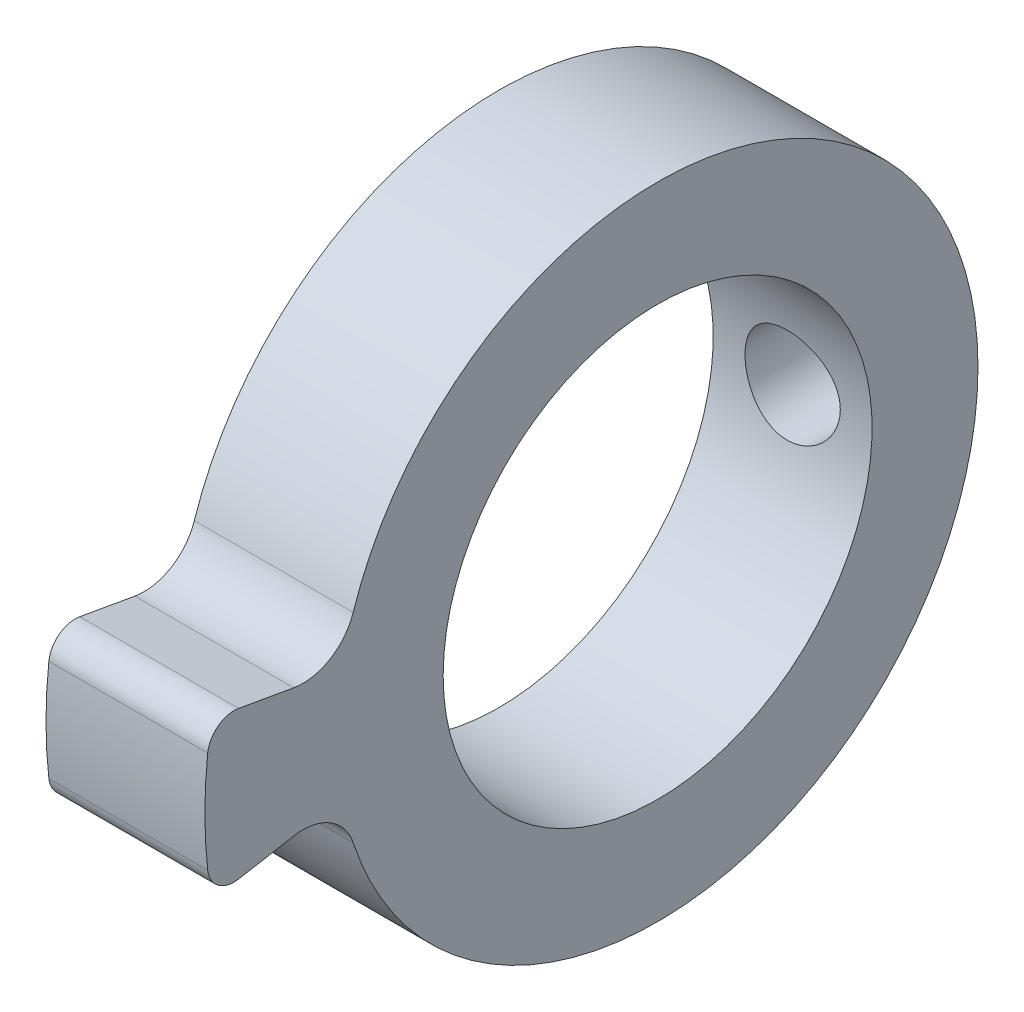
ISO-10303-21;
HEADER;
FILE_DESCRIPTION(('STEP AP214'),'2;1');
FILE_NAME('part.step','',(''),(''),'','','');
FILE_SCHEMA(('AUTOMOTIVE_DESIGN { 1 0 10303 214 1 1 1 1 }'));
ENDSEC;
DATA;
#1=APPLICATION_CONTEXT('core data for automotive mechanical design processes');
#2=APPLICATION_PROTOCOL_DEFINITION('international standard','automotive_design',2000,#1);
#3=PRODUCT_CONTEXT('',#1,'mechanical');
#4=PRODUCT('Part','Part','',(#3));
#5=PRODUCT_RELATED_PRODUCT_CATEGORY('part','',(#4));
#6=PRODUCT_DEFINITION_FORMATION('','',#4);
#7=PRODUCT_DEFINITION_CONTEXT('part definition',#1,'design');
#8=PRODUCT_DEFINITION('design','',#6,#7);
#9=PRODUCT_DEFINITION_SHAPE('','',#8);
#10=(LENGTH_UNIT() NAMED_UNIT(*) SI_UNIT(.MILLI.,.METRE.));
#11=(NAMED_UNIT(*) PLANE_ANGLE_UNIT() SI_UNIT($,.RADIAN.));
#12=(NAMED_UNIT(*) SI_UNIT($,.STERADIAN.) SOLID_ANGLE_UNIT());
#13=UNCERTAINTY_MEASURE_WITH_UNIT(LENGTH_MEASURE(1.E-05),#10,'distance_accuracy_value','');
#14=(GEOMETRIC_REPRESENTATION_CONTEXT(3) GLOBAL_UNCERTAINTY_ASSIGNED_CONTEXT((#13)) GLOBAL_UNIT_ASSIGNED_CONTEXT((#10,
#11,#12)) REPRESENTATION_CONTEXT('',''));
#15=CARTESIAN_POINT('',(0.,0.,0.));
#16=DIRECTION('',(0.,0.,1.));
#17=DIRECTION('',(1.,0.,0.));
#18=AXIS2_PLACEMENT_3D('',#15,#16,#17);
#19=CARTESIAN_POINT('',(-3.99600435518086,0.,0.));
#20=DIRECTION('',(-1.,0.,0.));
#21=DIRECTION('',(0.,0.,1.));
#22=AXIS2_PLACEMENT_3D('',#19,#20,#21);
#23=CYLINDRICAL_SURFACE('',#22,4.05);
#24=CARTESIAN_POINT('',(2.4,0.,-4.05));
#25=CARTESIAN_POINT('',(2.39999832434408,-0.0498962145490416,-4.04999908298213));
#26=CARTESIAN_POINT('',(2.39583660825143,-0.099812504371329,-4.04906856298061));
#27=CARTESIAN_POINT('',(2.37931778744225,-0.19822587484641,-4.04544643990951));
#28=CARTESIAN_POINT('',(2.36695495469582,-0.246721938812544,-4.04275360597807));
#29=CARTESIAN_POINT('',(2.33444131327875,-0.340858474992687,-4.03590650926054));
#30=CARTESIAN_POINT('',(2.31429877035096,-0.386501918445127,-4.03175379797587));
#31=CARTESIAN_POINT('',(2.26682402438742,-0.473760081141192,-4.0224345094862));
#32=CARTESIAN_POINT('',(2.23949196091922,-0.515374878570005,-4.01726795196311));
#33=CARTESIAN_POINT('',(2.17793595070199,-0.594083841306314,-4.00639092378395));
#34=CARTESIAN_POINT('',(2.14361587403918,-0.631101875419589,-4.00067352738642));
#35=CARTESIAN_POINT('',(2.06926437295809,-0.698906209706265,-3.98938770485904));
#36=CARTESIAN_POINT('',(2.02923242668029,-0.729691939848847,-3.98381929239622));
#37=CARTESIAN_POINT('',(1.94402767017376,-0.784495995346575,-3.9733934771777));
#38=CARTESIAN_POINT('',(1.89880126888131,-0.808432839469814,-3.96854494084342));
#39=CARTESIAN_POINT('',(1.80484225723841,-0.848336845295285,-3.96020743358578));
#40=CARTESIAN_POINT('',(1.75611008152309,-0.86430499299043,-3.95671829447147));
#41=CARTESIAN_POINT('',(1.6573499352048,-0.887565861028817,-3.95156524256635));
#42=CARTESIAN_POINT('',(1.60735527820256,-0.894993601671307,-3.94987295613502));
#43=CARTESIAN_POINT('',(1.50680300199621,-0.901382719489527,-3.94842003178801));
#44=CARTESIAN_POINT('',(1.45624545511703,-0.900345172102481,-3.94865914850522));
#45=CARTESIAN_POINT('',(1.35700951776279,-0.889941723827856,-3.95101634466666));
#46=CARTESIAN_POINT('',(1.30831366913729,-0.880733090070975,-3.95309894123178));
#47=CARTESIAN_POINT('',(1.21317578550375,-0.854498208065155,-3.95885229386254));
#48=CARTESIAN_POINT('',(1.16673388076157,-0.83747150856743,-3.96252314159929));
#49=CARTESIAN_POINT('',(1.07698225272815,-0.795940527927934,-3.97107409486633));
#50=CARTESIAN_POINT('',(1.03370130269877,-0.771376137207085,-3.9759638596312));
#51=CARTESIAN_POINT('',(0.951817708267849,-0.715509306629321,-3.98639582059835));
#52=CARTESIAN_POINT('',(0.913215722180935,-0.684205920334232,-3.99193810839269));
#53=CARTESIAN_POINT('',(0.84088081079319,-0.614919076663421,-4.003202585757));
#54=CARTESIAN_POINT('',(0.807275946702726,-0.576801992369803,-4.00892602809542));
#55=CARTESIAN_POINT('',(0.746914321991799,-0.495407978141227,-4.01979527605043));
#56=CARTESIAN_POINT('',(0.720157693298148,-0.452130948826815,-4.02494107053792));
#57=CARTESIAN_POINT('',(0.674218825900438,-0.361486435830629,-4.03409278905123));
#58=CARTESIAN_POINT('',(0.655053790061286,-0.314109955043933,-4.03809611853447));
#59=CARTESIAN_POINT('',(0.62499254412396,-0.216700168941654,-4.04449261364815));
#60=CARTESIAN_POINT('',(0.614095091963645,-0.166667263917013,-4.04688602113553));
#61=CARTESIAN_POINT('',(0.601065594035174,-0.0664629674763795,-4.04975842992753));
#62=CARTESIAN_POINT('',(0.598758674927245,-0.0163153787935067,-4.0502756188003));
#63=CARTESIAN_POINT('',(0.602501146917168,0.0836486657676362,-4.04944451392769));
#64=CARTESIAN_POINT('',(0.608549951993753,0.133465144621791,-4.04809635100707));
#65=CARTESIAN_POINT('',(0.628687236825648,0.230770465798239,-4.04371016441376));
#66=CARTESIAN_POINT('',(0.642683605300554,0.278279321271967,-4.04069151153492));
#67=CARTESIAN_POINT('',(0.678216159350286,0.370274762635124,-4.03330239489058));
#68=CARTESIAN_POINT('',(0.699753001337705,0.414761085004579,-4.02893181344097));
#69=CARTESIAN_POINT('',(0.750116794559545,0.50016889795247,-4.01922968952438));
#70=CARTESIAN_POINT('',(0.779045974352775,0.54102857887451,-4.01388500065611));
#71=CARTESIAN_POINT('',(0.843239062095649,0.617376134244653,-4.00285364557086));
#72=CARTESIAN_POINT('',(0.878503821149446,0.652863285780356,-3.99716693347579));
#73=CARTESIAN_POINT('',(0.955170615111316,0.718152966859433,-3.98595995525615));
#74=CARTESIAN_POINT('',(0.996676840502971,0.747834218730328,-3.98044492948928));
#75=CARTESIAN_POINT('',(1.08418741548487,0.799805753652383,-3.97032927920239));
#76=CARTESIAN_POINT('',(1.13019156840394,0.82209635967138,-3.96572861472872));
#77=CARTESIAN_POINT('',(1.22514373009731,0.858501008533164,-3.95800740247017));
#78=CARTESIAN_POINT('',(1.27407319902098,0.872661538596414,-3.95487845846904));
#79=CARTESIAN_POINT('',(1.37369588318811,0.892539124462824,-3.95044042363826));
#80=CARTESIAN_POINT('',(1.42438880446168,0.898257580732601,-3.94913103096299));
#81=CARTESIAN_POINT('',(1.52487549522525,0.901027604884696,-3.9484998065204));
#82=CARTESIAN_POINT('',(1.57466377862703,0.898271609147698,-3.94913384266556));
#83=CARTESIAN_POINT('',(1.67304736948507,0.884602247047593,-3.95221799230896));
#84=CARTESIAN_POINT('',(1.72164269194057,0.873688983301075,-3.95466808296165));
#85=CARTESIAN_POINT('',(1.81610210410232,0.844109189913348,-3.96108642659186));
#86=CARTESIAN_POINT('',(1.86197564259672,0.825471524828039,-3.96504902332246));
#87=CARTESIAN_POINT('',(1.94997299664603,0.780996466567537,-3.97404794011076));
#88=CARTESIAN_POINT('',(1.9920964064838,0.755158295633369,-3.97908437614485));
#89=CARTESIAN_POINT('',(2.07234447402659,0.696381115457509,-3.98979469275898));
#90=CARTESIAN_POINT('',(2.11036749221519,0.66330533479967,-3.99547967115483));
#91=CARTESIAN_POINT('',(2.1803865332691,0.591267917675266,-4.00677288378024));
#92=CARTESIAN_POINT('',(2.21238115822878,0.552304919805044,-4.01238109993074));
#93=CARTESIAN_POINT('',(2.26984919231396,0.468965686790503,-4.02297866876961));
#94=CARTESIAN_POINT('',(2.29522883988072,0.424523536485726,-4.02795865574653));
#95=CARTESIAN_POINT('',(2.33811748688154,0.331902125900467,-4.03664426266162));
#96=CARTESIAN_POINT('',(2.35563298802077,0.283725991490847,-4.04035093471867));
#97=CARTESIAN_POINT('',(2.37922860762455,0.196262211478233,-4.04542265809299));
#98=CARTESIAN_POINT('',(2.38700281814983,0.157442396355756,-4.04712841060445));
#99=CARTESIAN_POINT('',(2.39738905693777,0.0790859024525372,-4.04941741856905));
#100=CARTESIAN_POINT('',(2.40000132817585,0.039549257501795,-4.05000072685626));
#101=CARTESIAN_POINT('',(2.4,0.,-4.05));
#102=B_SPLINE_CURVE_WITH_KNOTS('',3,(#24,#25,#26,#27,#28,#29,#30,#31,#32,#33,#34,#35,#36,#37,
#38,#39,#40,#41,#42,#43,#44,#45,#46,#47,#48,#49,#50,#51,#52,#53,#54,#55,#56,#57,#58,#59,#60,#61,
#62,#63,#64,#65,#66,#67,#68,#69,#70,#71,#72,#73,#74,#75,#76,#77,#78,#79,#80,#81,#82,#83,#84,#85,
#86,#87,#88,#89,#90,#91,#92,#93,#94,#95,#96,#97,#98,#99,#100,#101),.UNSPECIFIED.,.T.,.F.,(4,2,2,
2,2,2,2,2,2,2,2,2,2,2,2,2,2,2,2,2,2,2,2,2,2,2,2,2,2,2,2,2,2,2,2,2,2,2,4),(0.,0.149543860378408,
0.299192279062177,0.448682135583355,0.59816909032645,0.749871324009353,0.901587426707311,
1.05503983334089,1.20847324809483,1.35944606537148,1.51039970323465,1.65850950665602,
1.80662785986122,1.95595951369311,2.10531215366235,2.25800180914039,2.41069440586422,
2.56373105765056,2.71674471375894,2.8666259645592,3.0164967041052,3.16466491241324,
3.31284602225456,3.46319911467918,3.6135724202449,3.76681262897577,3.92004614029684,
4.07239451574859,4.22471761508884,4.37360753314086,4.52249557822286,4.670832204071,
4.81918485863873,4.9706294684077,5.12210915309884,5.27563164172304,5.4290269704192,
5.54756556311349,5.66609857599577),.UNSPECIFIED.);
#103=CARTESIAN_POINT('',(2.4,0.,-4.05));
#104=VERTEX_POINT('',#103);
#105=EDGE_CURVE('E169',#104,#104,#102,.T.);
#106=ORIENTED_EDGE('',*,*,#105,.T.);
#107=EDGE_LOOP('',(#106));
#108=FACE_BOUND('',#107,.T.);
#109=CARTESIAN_POINT('',(3.,0.,0.));
#110=DIRECTION('',(-1.,0.,0.));
#111=DIRECTION('',(0.,0.,1.));
#112=AXIS2_PLACEMENT_3D('',#109,#110,#111);
#113=CIRCLE('',#112,4.05);
#114=CARTESIAN_POINT('',(3.,0.,4.05));
#115=VERTEX_POINT('',#114);
#116=EDGE_CURVE('E181',#115,#115,#113,.T.);
#117=ORIENTED_EDGE('',*,*,#116,.F.);
#118=EDGE_LOOP('',(#117));
#119=FACE_BOUND('',#118,.T.);
#120=CARTESIAN_POINT('',(0.,0.,0.));
#121=DIRECTION('',(-1.,0.,0.));
#122=DIRECTION('',(0.,0.,1.));
#123=AXIS2_PLACEMENT_3D('',#120,#121,#122);
#124=CIRCLE('',#123,4.05);
#125=CARTESIAN_POINT('',(0.,0.,4.05));
#126=VERTEX_POINT('',#125);
#127=EDGE_CURVE('E126',#126,#126,#124,.T.);
#128=ORIENTED_EDGE('',*,*,#127,.T.);
#129=EDGE_LOOP('',(#128));
#130=FACE_BOUND('',#129,.T.);
#131=ADVANCED_FACE('F32',(#108,#119,#130),#23,.F.);
#132=CARTESIAN_POINT('',(0.,4.05,0.));
#133=DIRECTION('',(1.,0.,0.));
#134=DIRECTION('',(0.,0.,-1.));
#135=AXIS2_PLACEMENT_3D('',#132,#133,#134);
#136=PLANE('',#135);
#137=ORIENTED_EDGE('',*,*,#127,.F.);
#138=EDGE_LOOP('',(#137));
#139=FACE_BOUND('',#138,.T.);
#140=CARTESIAN_POINT('',(0.,0.,0.));
#141=DIRECTION('',(-1.,0.,0.));
#142=DIRECTION('',(0.,0.,1.));
#143=AXIS2_PLACEMENT_3D('',#140,#141,#142);
#144=CIRCLE('',#143,8.55);
#145=CARTESIAN_POINT('',(0.,-0.958837304822639,8.49606562020801));
#146=VERTEX_POINT('',#145);
#147=CARTESIAN_POINT('',(0.,0.958837304822639,8.49606562020801));
#148=VERTEX_POINT('',#147);
#149=EDGE_CURVE('E168',#146,#148,#144,.T.);
#150=ORIENTED_EDGE('',*,*,#149,.T.);
#151=CARTESIAN_POINT('',(0.,0.902764947815467,7.99921967750578));
#152=DIRECTION('',(1.,0.,0.));
#153=DIRECTION('',(0.,0.,-1.));
#154=AXIS2_PLACEMENT_3D('',#151,#152,#153);
#155=CIRCLE('',#154,0.5);
#156=CARTESIAN_POINT('',(0.,1.39516882432157,7.91239558867232));
#157=VERTEX_POINT('',#156);
#158=EDGE_CURVE('E152',#148,#157,#155,.F.);
#159=ORIENTED_EDGE('',*,*,#158,.T.);
#160=DIRECTION('',(0.,-0.173648177666931,-0.984807753012208));
#161=VECTOR('',#160,1.);
#162=CARTESIAN_POINT('',(0.,1.05057147488493,5.95808690572386));
#163=LINE('',#162,#161);
#164=CARTESIAN_POINT('',(0.,1.21184160189653,6.87269524509219));
#165=VERTEX_POINT('',#164);
#166=EDGE_CURVE('E110',#157,#165,#163,.T.);
#167=ORIENTED_EDGE('',*,*,#166,.T.);
#168=CARTESIAN_POINT('',(0.,2.19664935490874,6.69904706742526));
#169=DIRECTION('',(1.,0.,0.));
#170=DIRECTION('',(0.,0.,-1.));
#171=AXIS2_PLACEMENT_3D('',#168,#169,#170);
#172=CIRCLE('',#171,1.);
#173=CARTESIAN_POINT('',(0.,1.88506788612736,5.74882762523728));
#174=VERTEX_POINT('',#173);
#175=EDGE_CURVE('E105',#165,#174,#172,.T.);
#176=ORIENTED_EDGE('',*,*,#175,.T.);
#177=CARTESIAN_POINT('',(0.,0.,0.));
#178=DIRECTION('',(-1.,0.,0.));
#179=DIRECTION('',(0.,0.,1.));
#180=AXIS2_PLACEMENT_3D('',#177,#178,#179);
#181=CIRCLE('',#180,6.05);
#182=CARTESIAN_POINT('',(0.,-1.88506788612736,5.74882762523728));
#183=VERTEX_POINT('',#182);
#184=EDGE_CURVE('E109',#174,#183,#181,.T.);
#185=ORIENTED_EDGE('',*,*,#184,.T.);
#186=CARTESIAN_POINT('',(0.,-2.19664935490874,6.69904706742526));
#187=DIRECTION('',(1.,0.,0.));
#188=DIRECTION('',(0.,0.,-1.));
#189=AXIS2_PLACEMENT_3D('',#186,#187,#188);
#190=CIRCLE('',#189,1.);
#191=CARTESIAN_POINT('',(0.,-1.21184160189653,6.87269524509219));
#192=VERTEX_POINT('',#191);
#193=EDGE_CURVE('E141',#183,#192,#190,.T.);
#194=ORIENTED_EDGE('',*,*,#193,.T.);
#195=DIRECTION('',(0.,-0.173648177666931,0.984807753012208));
#196=VECTOR('',#195,1.);
#197=CARTESIAN_POINT('',(0.,-1.05057147488493,5.95808690572386));
#198=LINE('',#197,#196);
#199=CARTESIAN_POINT('',(0.,-1.39516882432157,7.91239558867232));
#200=VERTEX_POINT('',#199);
#201=EDGE_CURVE('E163',#192,#200,#198,.T.);
#202=ORIENTED_EDGE('',*,*,#201,.T.);
#203=CARTESIAN_POINT('',(0.,-0.902764947815467,7.99921967750578));
#204=DIRECTION('',(1.,0.,0.));
#205=DIRECTION('',(0.,0.,-1.));
#206=AXIS2_PLACEMENT_3D('',#203,#204,#205);
#207=CIRCLE('',#206,0.5);
#208=EDGE_CURVE('E150',#200,#146,#207,.F.);
#209=ORIENTED_EDGE('',*,*,#208,.T.);
#210=EDGE_LOOP('',(#150,#159,#167,#176,#185,#194,#202,#209));
#211=FACE_BOUND('',#210,.T.);
#212=ADVANCED_FACE('F108',(#139,#211),#136,.F.);
#213=CARTESIAN_POINT('',(-3.99600435518086,0.,0.));
#214=DIRECTION('',(-1.,0.,0.));
#215=DIRECTION('',(0.,0.,1.));
#216=AXIS2_PLACEMENT_3D('',#213,#214,#215);
#217=CYLINDRICAL_SURFACE('',#216,6.05);
#218=CARTESIAN_POINT('',(2.4,0.,-6.05));
#219=CARTESIAN_POINT('',(2.39999792378745,0.0502558634951687,-6.04999919917789));
#220=CARTESIAN_POINT('',(2.39577637052018,0.100541008798927,-6.04936724008117));
#221=CARTESIAN_POINT('',(2.37900578102299,0.199706092458043,-6.0469070495936));
#222=CARTESIAN_POINT('',(2.36644860488621,0.248584608484365,-6.04507764890083));
#223=CARTESIAN_POINT('',(2.33339000075672,0.343486938998112,-6.04042818589971));
#224=CARTESIAN_POINT('',(2.31289454210534,0.389512868445747,-6.03760886812672));
#225=CARTESIAN_POINT('',(2.2645556718985,0.477465114100465,-6.03129121336626));
#226=CARTESIAN_POINT('',(2.2367132936443,0.51939200567767,-6.02779297188373));
#227=CARTESIAN_POINT('',(2.17424279954044,0.59828550582681,-6.02047649259506));
#228=CARTESIAN_POINT('',(2.13956935124769,0.635216033792256,-6.01665622031005));
#229=CARTESIAN_POINT('',(2.06451851111655,0.702757216959348,-6.00914219737157));
#230=CARTESIAN_POINT('',(2.02414079354164,0.733367511004559,-6.00544845395837));
#231=CARTESIAN_POINT('',(1.93858557311659,0.787539455289645,-5.99858595303456));
#232=CARTESIAN_POINT('',(1.89338577334668,0.811066253318218,-5.99541982448867));
#233=CARTESIAN_POINT('',(1.79962124823457,0.850180648282277,-5.98999876374504));
#234=CARTESIAN_POINT('',(1.75105670340181,0.865768670737423,-5.98774378271098));
#235=CARTESIAN_POINT('',(1.65232047067389,0.888451097702981,-5.98442030700855));
#236=CARTESIAN_POINT('',(1.60216325894411,0.895607230877466,-5.98334319357415));
#237=CARTESIAN_POINT('',(1.50134923640799,0.901413960799804,-5.98247123098475));
#238=CARTESIAN_POINT('',(1.45069245398288,0.900065037982499,-5.98267630940111));
#239=CARTESIAN_POINT('',(1.35075299342789,0.888950404759469,-5.98433767759988));
#240=CARTESIAN_POINT('',(1.30146247957095,0.87925340427783,-5.98578375289325));
#241=CARTESIAN_POINT('',(1.20521600960918,0.851825417432666,-5.98974822347629));
#242=CARTESIAN_POINT('',(1.1582601185914,0.834094207222297,-5.99226664864335));
#243=CARTESIAN_POINT('',(1.06780650989359,0.791029534188185,-5.99810335455463));
#244=CARTESIAN_POINT('',(1.02432287292084,0.765666927295336,-6.00142469186245));
#245=CARTESIAN_POINT('',(0.942202654784249,0.70808017284055,-6.00849077354763));
#246=CARTESIAN_POINT('',(0.903566386839398,0.675855582245202,-6.01223554525606));
#247=CARTESIAN_POINT('',(0.831839399777447,0.605082243999626,-6.01977169992947));
#248=CARTESIAN_POINT('',(0.79880696001187,0.566474413726025,-6.02356317908749));
#249=CARTESIAN_POINT('',(0.739681489989974,0.484232010172869,-6.0307313258485));
#250=CARTESIAN_POINT('',(0.713588489223701,0.440597415532558,-6.03410799168866));
#251=CARTESIAN_POINT('',(0.669079743077999,0.349489892166042,-6.04006949764793));
#252=CARTESIAN_POINT('',(0.65066844878884,0.302014757042686,-6.04265387845581));
#253=CARTESIAN_POINT('',(0.622096174679114,0.204599449340241,-6.04673576893956));
#254=CARTESIAN_POINT('',(0.611934646366473,0.154659440874391,-6.0482333508714));
#255=CARTESIAN_POINT('',(0.600227743262345,0.0542350418340052,-6.04996334640894));
#256=CARTESIAN_POINT('',(0.598602237568765,0.0037601876533022,-6.05020752569304));
#257=CARTESIAN_POINT('',(0.603800895151379,-0.0967413833519919,-6.04943521685332));
#258=CARTESIAN_POINT('',(0.610624801277762,-0.146768113768133,-6.04841876709555));
#259=CARTESIAN_POINT('',(0.632461947416179,-0.244710981036564,-6.04524668869712));
#260=CARTESIAN_POINT('',(0.647436192802801,-0.292636002852724,-6.04309648592326));
#261=CARTESIAN_POINT('',(0.685107863081553,-0.385295169510446,-6.03789723670636));
#262=CARTESIAN_POINT('',(0.707805645490186,-0.430029166525987,-6.03484814865548));
#263=CARTESIAN_POINT('',(0.760468390241755,-0.515389100083239,-6.02816078069074));
#264=CARTESIAN_POINT('',(0.790484236610629,-0.555983319587023,-6.02451843732657));
#265=CARTESIAN_POINT('',(0.856860164719232,-0.6315868178859,-6.0170627366718));
#266=CARTESIAN_POINT('',(0.893220608781471,-0.666595777503481,-6.01324936962375));
#267=CARTESIAN_POINT('',(0.971610123866081,-0.730326159878557,-6.00584415756205));
#268=CARTESIAN_POINT('',(1.01368306407458,-0.758993898921996,-6.00225437599996));
#269=CARTESIAN_POINT('',(1.1020942822889,-0.808855041125473,-5.99573919391685));
#270=CARTESIAN_POINT('',(1.1484324465081,-0.830048643605891,-5.99281377567933));
#271=CARTESIAN_POINT('',(1.2438979595954,-0.864276501533626,-5.9879734393391));
#272=CARTESIAN_POINT('',(1.29301495521933,-0.87733911541536,-5.98605501286513));
#273=CARTESIAN_POINT('',(1.39277624993902,-0.895024513554679,-5.98343650400927));
#274=CARTESIAN_POINT('',(1.44342044521195,-0.899647870224964,-5.98273633899605));
#275=CARTESIAN_POINT('',(1.5442635120879,-0.900310063053321,-5.9826366783385));
#276=CARTESIAN_POINT('',(1.5944618372099,-0.896433303872868,-5.98322439422932));
#277=CARTESIAN_POINT('',(1.69348417431212,-0.880386071992143,-5.98560649731138));
#278=CARTESIAN_POINT('',(1.74230818835128,-0.868215611717846,-5.98740088269475));
#279=CARTESIAN_POINT('',(1.83717323109969,-0.835956118331376,-5.99198969936934));
#280=CARTESIAN_POINT('',(1.88321627058722,-0.815872887533092,-5.99478339774161));
#281=CARTESIAN_POINT('',(1.9712930020803,-0.768366331443815,-6.00105696883444));
#282=CARTESIAN_POINT('',(2.01332656277835,-0.74094276587411,-6.004536864016));
#283=CARTESIAN_POINT('',(2.09262014070007,-0.679226982188195,-6.01183188537711));
#284=CARTESIAN_POINT('',(2.12983122606342,-0.644872226558203,-6.01564987202461));
#285=CARTESIAN_POINT('',(2.19799030152955,-0.570401401426823,-6.02316693062578));
#286=CARTESIAN_POINT('',(2.22893683290985,-0.530283993781821,-6.02686597471499));
#287=CARTESIAN_POINT('',(2.28383756780188,-0.445171640735323,-6.03375118783376));
#288=CARTESIAN_POINT('',(2.3077530467237,-0.400151487867109,-6.03693447467343));
#289=CARTESIAN_POINT('',(2.34764734301484,-0.306707449991162,-6.04240120495461));
#290=CARTESIAN_POINT('',(2.36363440217537,-0.258287159558637,-6.04468558232256));
#291=CARTESIAN_POINT('',(2.38358041280467,-0.17470653937362,-6.04757408670751));
#292=CARTESIAN_POINT('',(2.38972837826445,-0.140062760464099,-6.0484791450006));
#293=CARTESIAN_POINT('',(2.39793887315939,-0.0702840916342137,-6.049692378079));
#294=CARTESIAN_POINT('',(2.40000145211366,-0.0351492076717479,-6.05000056009908));
#295=CARTESIAN_POINT('',(2.4,0.,-6.05));
#296=B_SPLINE_CURVE_WITH_KNOTS('',3,(#218,#219,#220,#221,#222,#223,#224,#225,#226,#227,#228,
#229,#230,#231,#232,#233,#234,#235,#236,#237,#238,#239,#240,#241,#242,#243,#244,#245,#246,#247,
#248,#249,#250,#251,#252,#253,#254,#255,#256,#257,#258,#259,#260,#261,#262,#263,#264,#265,#266,
#267,#268,#269,#270,#271,#272,#273,#274,#275,#276,#277,#278,#279,#280,#281,#282,#283,#284,#285,
#286,#287,#288,#289,#290,#291,#292,#293,#294,#295),.UNSPECIFIED.,.T.,.F.,(4,2,2,2,2,2,2,2,2,2,2,
2,2,2,2,2,2,2,2,2,2,2,2,2,2,2,2,2,2,2,2,2,2,2,2,2,2,2,4),(0.,0.150639154189215,
0.301425627430261,0.452098933387972,0.602751059311278,0.754438835886088,0.906135277941512,
1.05856633786179,1.21098922659237,1.36228917560877,1.51358057804819,1.66363853413199,
1.81370067134456,1.96434332609819,2.11499570981333,2.26712980033454,2.41926453735896,
2.57148730536399,2.72369995189153,2.87448113231156,3.02525772396257,3.17531919860902,
3.32538762042919,3.47653084847425,3.62768271071961,3.7800689929128,3.93245121095909,
4.08429894342621,4.23613637607681,4.38647292360735,4.53680924589779,4.68703553341616,
4.83726673904731,4.98891946878116,5.14060747084663,5.29311590522576,5.44546546920024,
5.55082454028237,5.65618233429584),.UNSPECIFIED.);
#297=CARTESIAN_POINT('',(2.4,0.,-6.05));
#298=VERTEX_POINT('',#297);
#299=EDGE_CURVE('E11',#298,#298,#296,.T.);
#300=ORIENTED_EDGE('',*,*,#299,.T.);
#301=EDGE_LOOP('',(#300));
#302=FACE_BOUND('',#301,.T.);
#303=CARTESIAN_POINT('',(3.,0.,0.));
#304=DIRECTION('',(-1.,0.,0.));
#305=DIRECTION('',(0.,0.,1.));
#306=AXIS2_PLACEMENT_3D('',#303,#304,#305);
#307=CIRCLE('',#306,6.05);
#308=CARTESIAN_POINT('',(3.,1.88506788612736,5.74882762523728));
#309=VERTEX_POINT('',#308);
#310=CARTESIAN_POINT('',(3.,-1.88506788612736,5.74882762523728));
#311=VERTEX_POINT('',#310);
#312=EDGE_CURVE('E127',#309,#311,#307,.T.);
#313=ORIENTED_EDGE('',*,*,#312,.T.);
#314=DIRECTION('',(-1.,0.,0.));
#315=VECTOR('',#314,1.);
#316=CARTESIAN_POINT('',(-3.99600435518086,-1.88506788612736,5.74882762523728));
#317=LINE('',#316,#315);
#318=EDGE_CURVE('E125',#311,#183,#317,.T.);
#319=ORIENTED_EDGE('',*,*,#318,.T.);
#320=ORIENTED_EDGE('',*,*,#184,.F.);
#321=DIRECTION('',(-1.,0.,0.));
#322=VECTOR('',#321,1.);
#323=CARTESIAN_POINT('',(-3.99600435518086,1.88506788612736,5.74882762523728));
#324=LINE('',#323,#322);
#325=EDGE_CURVE('E122',#174,#309,#324,.F.);
#326=ORIENTED_EDGE('',*,*,#325,.T.);
#327=EDGE_LOOP('',(#313,#319,#320,#326));
#328=FACE_BOUND('',#327,.T.);
#329=ADVANCED_FACE('F121',(#302,#328),#217,.T.);
#330=CARTESIAN_POINT('',(3.,6.05,0.));
#331=DIRECTION('',(-1.,0.,0.));
#332=DIRECTION('',(0.,0.,1.));
#333=AXIS2_PLACEMENT_3D('',#330,#331,#332);
#334=PLANE('',#333);
#335=DIRECTION('',(0.,0.173648177666931,0.984807753012208));
#336=VECTOR('',#335,1.);
#337=CARTESIAN_POINT('',(3.,1.05057147488493,5.95808690572386));
#338=LINE('',#337,#336);
#339=CARTESIAN_POINT('',(3.,1.21184160189653,6.87269524509219));
#340=VERTEX_POINT('',#339);
#341=CARTESIAN_POINT('',(3.,1.39516882432157,7.91239558867232));
#342=VERTEX_POINT('',#341);
#343=EDGE_CURVE('E175',#340,#342,#338,.T.);
#344=ORIENTED_EDGE('',*,*,#343,.T.);
#345=CARTESIAN_POINT('',(3.,0.902764947815467,7.99921967750578));
#346=DIRECTION('',(-1.,0.,0.));
#347=DIRECTION('',(0.,0.,1.));
#348=AXIS2_PLACEMENT_3D('',#345,#346,#347);
#349=CIRCLE('',#348,0.5);
#350=CARTESIAN_POINT('',(3.,0.958837304822639,8.49606562020801));
#351=VERTEX_POINT('',#350);
#352=EDGE_CURVE('E156',#342,#351,#349,.F.);
#353=ORIENTED_EDGE('',*,*,#352,.T.);
#354=CARTESIAN_POINT('',(3.,0.,0.));
#355=DIRECTION('',(-1.,0.,0.));
#356=DIRECTION('',(0.,0.,1.));
#357=AXIS2_PLACEMENT_3D('',#354,#355,#356);
#358=CIRCLE('',#357,8.55);
#359=CARTESIAN_POINT('',(3.,-0.958837304822639,8.49606562020801));
#360=VERTEX_POINT('',#359);
#361=EDGE_CURVE('E179',#351,#360,#358,.F.);
#362=ORIENTED_EDGE('',*,*,#361,.T.);
#363=CARTESIAN_POINT('',(3.,-0.902764947815467,7.99921967750578));
#364=DIRECTION('',(-1.,0.,0.));
#365=DIRECTION('',(0.,0.,1.));
#366=AXIS2_PLACEMENT_3D('',#363,#364,#365);
#367=CIRCLE('',#366,0.5);
#368=CARTESIAN_POINT('',(3.,-1.39516882432157,7.91239558867232));
#369=VERTEX_POINT('',#368);
#370=EDGE_CURVE('E52',#360,#369,#367,.F.);
#371=ORIENTED_EDGE('',*,*,#370,.T.);
#372=DIRECTION('',(0.,0.173648177666931,-0.984807753012208));
#373=VECTOR('',#372,1.);
#374=CARTESIAN_POINT('',(3.,-1.05057147488493,5.95808690572386));
#375=LINE('',#374,#373);
#376=CARTESIAN_POINT('',(3.,-1.21184160189653,6.87269524509219));
#377=VERTEX_POINT('',#376);
#378=EDGE_CURVE('E165',#369,#377,#375,.T.);
#379=ORIENTED_EDGE('',*,*,#378,.T.);
#380=CARTESIAN_POINT('',(3.,-2.19664935490874,6.69904706742526));
#381=DIRECTION('',(-1.,0.,0.));
#382=DIRECTION('',(0.,0.,1.));
#383=AXIS2_PLACEMENT_3D('',#380,#381,#382);
#384=CIRCLE('',#383,1.);
#385=EDGE_CURVE('E116',#377,#311,#384,.T.);
#386=ORIENTED_EDGE('',*,*,#385,.T.);
#387=ORIENTED_EDGE('',*,*,#312,.F.);
#388=CARTESIAN_POINT('',(3.,2.19664935490874,6.69904706742526));
#389=DIRECTION('',(-1.,0.,0.));
#390=DIRECTION('',(0.,0.,1.));
#391=AXIS2_PLACEMENT_3D('',#388,#389,#390);
#392=CIRCLE('',#391,1.);
#393=EDGE_CURVE('E115',#309,#340,#392,.T.);
#394=ORIENTED_EDGE('',*,*,#393,.T.);
#395=EDGE_LOOP('',(#344,#353,#362,#371,#379,#386,#387,#394));
#396=FACE_BOUND('',#395,.T.);
#397=ORIENTED_EDGE('',*,*,#116,.T.);
#398=EDGE_LOOP('',(#397));
#399=FACE_BOUND('',#398,.T.);
#400=ADVANCED_FACE('F187',(#396,#399),#334,.F.);
#401=CARTESIAN_POINT('',(6.9414786395814,1.05057147488493,5.95808690572386));
#402=DIRECTION('',(0.,0.984807753012208,-0.173648177666931));
#403=DIRECTION('',(0.,0.173648177666931,0.984807753012208));
#404=AXIS2_PLACEMENT_3D('',#401,#402,#403);
#405=PLANE('',#404);
#406=ORIENTED_EDGE('',*,*,#166,.F.);
#407=DIRECTION('',(-1.,0.,0.));
#408=VECTOR('',#407,1.);
#409=CARTESIAN_POINT('',(6.9414786395814,1.39516882432157,7.91239558867232));
#410=LINE('',#409,#408);
#411=EDGE_CURVE('E60',#157,#342,#410,.F.);
#412=ORIENTED_EDGE('',*,*,#411,.T.);
#413=ORIENTED_EDGE('',*,*,#343,.F.);
#414=DIRECTION('',(-1.,0.,0.));
#415=VECTOR('',#414,1.);
#416=CARTESIAN_POINT('',(6.9414786395814,1.21184160189653,6.87269524509219));
#417=LINE('',#416,#415);
#418=EDGE_CURVE('E139',#340,#165,#417,.T.);
#419=ORIENTED_EDGE('',*,*,#418,.T.);
#420=EDGE_LOOP('',(#406,#412,#413,#419));
#421=FACE_BOUND('',#420,.T.);
#422=ADVANCED_FACE('F191',(#421),#405,.T.);
#423=CARTESIAN_POINT('',(6.9414786395814,0.,0.));
#424=DIRECTION('',(-1.,0.,0.));
#425=DIRECTION('',(0.,0.,1.));
#426=AXIS2_PLACEMENT_3D('',#423,#424,#425);
#427=CYLINDRICAL_SURFACE('',#426,8.55);
#428=ORIENTED_EDGE('',*,*,#361,.F.);
#429=DIRECTION('',(-1.,0.,0.));
#430=VECTOR('',#429,1.);
#431=CARTESIAN_POINT('',(6.9414786395814,0.958837304822639,8.49606562020801));
#432=LINE('',#431,#430);
#433=EDGE_CURVE('E147',#351,#148,#432,.T.);
#434=ORIENTED_EDGE('',*,*,#433,.T.);
#435=ORIENTED_EDGE('',*,*,#149,.F.);
#436=DIRECTION('',(-1.,0.,0.));
#437=VECTOR('',#436,1.);
#438=CARTESIAN_POINT('',(6.9414786395814,-0.958837304822639,8.49606562020801));
#439=LINE('',#438,#437);
#440=EDGE_CURVE('E145',#146,#360,#439,.F.);
#441=ORIENTED_EDGE('',*,*,#440,.T.);
#442=EDGE_LOOP('',(#428,#434,#435,#441));
#443=FACE_BOUND('',#442,.T.);
#444=ADVANCED_FACE('F222',(#443),#427,.T.);
#445=CARTESIAN_POINT('',(6.9414786395814,-1.05057147488493,5.95808690572386));
#446=DIRECTION('',(0.,-0.984807753012208,-0.173648177666931));
#447=DIRECTION('',(0.,0.173648177666931,-0.984807753012208));
#448=AXIS2_PLACEMENT_3D('',#445,#446,#447);
#449=PLANE('',#448);
#450=ORIENTED_EDGE('',*,*,#378,.F.);
#451=DIRECTION('',(-1.,0.,0.));
#452=VECTOR('',#451,1.);
#453=CARTESIAN_POINT('',(6.9414786395814,-1.39516882432157,7.91239558867232));
#454=LINE('',#453,#452);
#455=EDGE_CURVE('E45',#369,#200,#454,.T.);
#456=ORIENTED_EDGE('',*,*,#455,.T.);
#457=ORIENTED_EDGE('',*,*,#201,.F.);
#458=DIRECTION('',(-1.,0.,0.));
#459=VECTOR('',#458,1.);
#460=CARTESIAN_POINT('',(6.9414786395814,-1.21184160189653,6.87269524509219));
#461=LINE('',#460,#459);
#462=EDGE_CURVE('E132',#192,#377,#461,.F.);
#463=ORIENTED_EDGE('',*,*,#462,.T.);
#464=EDGE_LOOP('',(#450,#456,#457,#463));
#465=FACE_BOUND('',#464,.T.);
#466=ADVANCED_FACE('F162',(#465),#449,.T.);
#467=CARTESIAN_POINT('',(-3.99600435518086,-2.19664935490874,6.69904706742526));
#468=DIRECTION('',(-1.,0.,0.));
#469=DIRECTION('',(0.,0.,1.));
#470=AXIS2_PLACEMENT_3D('',#467,#468,#469);
#471=CYLINDRICAL_SURFACE('',#470,1.);
#472=ORIENTED_EDGE('',*,*,#385,.F.);
#473=ORIENTED_EDGE('',*,*,#462,.F.);
#474=ORIENTED_EDGE('',*,*,#193,.F.);
#475=ORIENTED_EDGE('',*,*,#318,.F.);
#476=EDGE_LOOP('',(#472,#473,#474,#475));
#477=FACE_BOUND('',#476,.T.);
#478=ADVANCED_FACE('F186',(#477),#471,.F.);
#479=CARTESIAN_POINT('',(-3.99600435518086,2.19664935490874,6.69904706742526));
#480=DIRECTION('',(-1.,0.,0.));
#481=DIRECTION('',(0.,0.,1.));
#482=AXIS2_PLACEMENT_3D('',#479,#480,#481);
#483=CYLINDRICAL_SURFACE('',#482,1.);
#484=ORIENTED_EDGE('',*,*,#393,.F.);
#485=ORIENTED_EDGE('',*,*,#325,.F.);
#486=ORIENTED_EDGE('',*,*,#175,.F.);
#487=ORIENTED_EDGE('',*,*,#418,.F.);
#488=EDGE_LOOP('',(#484,#485,#486,#487));
#489=FACE_BOUND('',#488,.T.);
#490=ADVANCED_FACE('F130',(#489),#483,.F.);
#491=CARTESIAN_POINT('',(6.9414786395814,0.902764947815467,7.99921967750578));
#492=DIRECTION('',(-1.,0.,0.));
#493=DIRECTION('',(0.,0.,1.));
#494=AXIS2_PLACEMENT_3D('',#491,#492,#493);
#495=CYLINDRICAL_SURFACE('',#494,0.5);
#496=ORIENTED_EDGE('',*,*,#352,.F.);
#497=ORIENTED_EDGE('',*,*,#411,.F.);
#498=ORIENTED_EDGE('',*,*,#158,.F.);
#499=ORIENTED_EDGE('',*,*,#433,.F.);
#500=EDGE_LOOP('',(#496,#497,#498,#499));
#501=FACE_BOUND('',#500,.T.);
#502=ADVANCED_FACE('F233',(#501),#495,.T.);
#503=CARTESIAN_POINT('',(6.9414786395814,-0.902764947815467,7.99921967750578));
#504=DIRECTION('',(-1.,0.,0.));
#505=DIRECTION('',(0.,0.,1.));
#506=AXIS2_PLACEMENT_3D('',#503,#504,#505);
#507=CYLINDRICAL_SURFACE('',#506,0.5);
#508=ORIENTED_EDGE('',*,*,#370,.F.);
#509=ORIENTED_EDGE('',*,*,#440,.F.);
#510=ORIENTED_EDGE('',*,*,#208,.F.);
#511=ORIENTED_EDGE('',*,*,#455,.F.);
#512=EDGE_LOOP('',(#508,#509,#510,#511));
#513=FACE_BOUND('',#512,.T.);
#514=ADVANCED_FACE('F34',(#513),#507,.T.);
#515=CARTESIAN_POINT('',(1.5,0.,0.));
#516=DIRECTION('',(0.,0.,1.));
#517=DIRECTION('',(1.,0.,0.));
#518=AXIS2_PLACEMENT_3D('',#515,#516,#517);
#519=CYLINDRICAL_SURFACE('',#518,0.899999999999998);
#520=ORIENTED_EDGE('',*,*,#299,.F.);
#521=EDGE_LOOP('',(#520));
#522=FACE_BOUND('',#521,.T.);
#523=ORIENTED_EDGE('',*,*,#105,.F.);
#524=EDGE_LOOP('',(#523));
#525=FACE_BOUND('',#524,.T.);
#526=ADVANCED_FACE('F214',(#522,#525),#519,.F.);
#527=CLOSED_SHELL('',(#131,#212,#329,#400,#422,#444,#466,#478,#490,#502,#514,#526));
#528=MANIFOLD_SOLID_BREP('B2',#527);
#529=ADVANCED_BREP_SHAPE_REPRESENTATION('',(#18,#528),#14);
#530=SHAPE_DEFINITION_REPRESENTATION(#9,#529);
ENDSEC;
END-ISO-10303-21;
